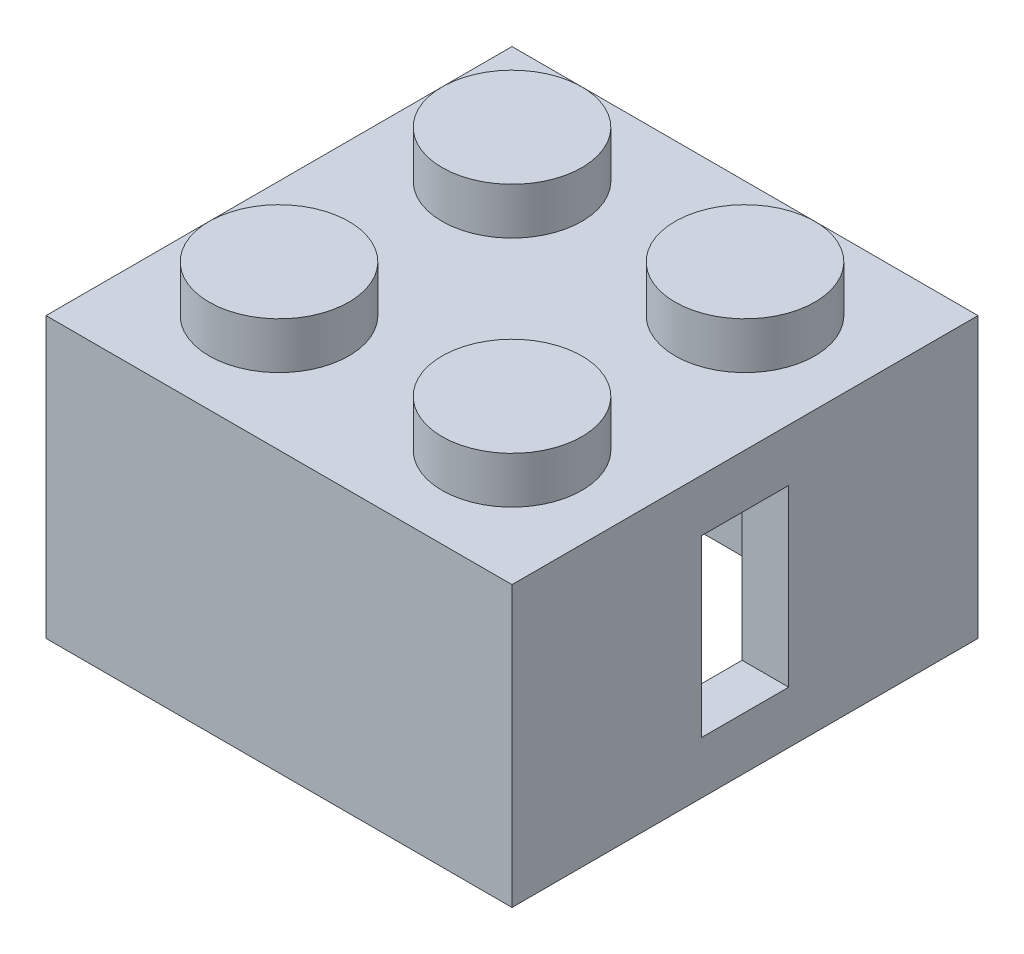
ISO-10303-21;
HEADER;
FILE_DESCRIPTION(('STEP AP214'),'2;1');
FILE_NAME('part.step','',(''),(''),'','','');
FILE_SCHEMA(('AUTOMOTIVE_DESIGN { 1 0 10303 214 1 1 1 1 }'));
ENDSEC;
DATA;
#1=APPLICATION_CONTEXT('core data for automotive mechanical design processes');
#2=APPLICATION_PROTOCOL_DEFINITION('international standard','automotive_design',2000,#1);
#3=PRODUCT_CONTEXT('',#1,'mechanical');
#4=PRODUCT('Part','Part','',(#3));
#5=PRODUCT_RELATED_PRODUCT_CATEGORY('part','',(#4));
#6=PRODUCT_DEFINITION_FORMATION('','',#4);
#7=PRODUCT_DEFINITION_CONTEXT('part definition',#1,'design');
#8=PRODUCT_DEFINITION('design','',#6,#7);
#9=PRODUCT_DEFINITION_SHAPE('','',#8);
#10=(LENGTH_UNIT() NAMED_UNIT(*) SI_UNIT(.MILLI.,.METRE.));
#11=(NAMED_UNIT(*) PLANE_ANGLE_UNIT() SI_UNIT($,.RADIAN.));
#12=(NAMED_UNIT(*) SI_UNIT($,.STERADIAN.) SOLID_ANGLE_UNIT());
#13=UNCERTAINTY_MEASURE_WITH_UNIT(LENGTH_MEASURE(1.E-05),#10,'distance_accuracy_value','');
#14=(GEOMETRIC_REPRESENTATION_CONTEXT(3) GLOBAL_UNCERTAINTY_ASSIGNED_CONTEXT((#13)) GLOBAL_UNIT_ASSIGNED_CONTEXT((#10,
#11,#12)) REPRESENTATION_CONTEXT('',''));
#15=CARTESIAN_POINT('',(0.,0.,0.));
#16=DIRECTION('',(0.,0.,1.));
#17=DIRECTION('',(1.,0.,0.));
#18=AXIS2_PLACEMENT_3D('',#15,#16,#17);
#19=CARTESIAN_POINT('',(0.,0.,0.));
#20=DIRECTION('',(0.,-1.,0.));
#21=DIRECTION('',(0.,0.,-1.));
#22=AXIS2_PLACEMENT_3D('',#19,#20,#21);
#23=PLANE('',#22);
#24=DIRECTION('',(0.,0.,1.));
#25=VECTOR('',#24,1.);
#26=CARTESIAN_POINT('',(0.,0.,0.));
#27=LINE('',#26,#25);
#28=CARTESIAN_POINT('',(0.,0.,-16.));
#29=VERTEX_POINT('',#28);
#30=CARTESIAN_POINT('',(0.,0.,0.));
#31=VERTEX_POINT('',#30);
#32=EDGE_CURVE('E242',#29,#31,#27,.T.);
#33=ORIENTED_EDGE('',*,*,#32,.F.);
#34=DIRECTION('',(-1.,0.,0.));
#35=VECTOR('',#34,1.);
#36=CARTESIAN_POINT('',(0.,0.,-16.));
#37=LINE('',#36,#35);
#38=CARTESIAN_POINT('',(16.,0.,-16.));
#39=VERTEX_POINT('',#38);
#40=EDGE_CURVE('E249',#39,#29,#37,.T.);
#41=ORIENTED_EDGE('',*,*,#40,.F.);
#42=DIRECTION('',(0.,0.,-1.));
#43=VECTOR('',#42,1.);
#44=CARTESIAN_POINT('',(16.,0.,0.));
#45=LINE('',#44,#43);
#46=CARTESIAN_POINT('',(16.,0.,0.));
#47=VERTEX_POINT('',#46);
#48=EDGE_CURVE('E247',#47,#39,#45,.T.);
#49=ORIENTED_EDGE('',*,*,#48,.F.);
#50=DIRECTION('',(1.,0.,0.));
#51=VECTOR('',#50,1.);
#52=CARTESIAN_POINT('',(0.,0.,0.));
#53=LINE('',#52,#51);
#54=EDGE_CURVE('E245',#31,#47,#53,.T.);
#55=ORIENTED_EDGE('',*,*,#54,.F.);
#56=EDGE_LOOP('',(#33,#41,#49,#55));
#57=FACE_BOUND('',#56,.T.);
#58=DIRECTION('',(0.,0.,1.));
#59=VECTOR('',#58,1.);
#60=CARTESIAN_POINT('',(1.6,0.,-1.6));
#61=LINE('',#60,#59);
#62=CARTESIAN_POINT('',(1.6,0.,-14.4));
#63=VERTEX_POINT('',#62);
#64=CARTESIAN_POINT('',(1.6,0.,-1.6));
#65=VERTEX_POINT('',#64);
#66=EDGE_CURVE('E211',#63,#65,#61,.T.);
#67=ORIENTED_EDGE('',*,*,#66,.T.);
#68=DIRECTION('',(1.,0.,0.));
#69=VECTOR('',#68,1.);
#70=CARTESIAN_POINT('',(1.6,0.,-1.6));
#71=LINE('',#70,#69);
#72=CARTESIAN_POINT('',(14.4,0.,-1.6));
#73=VERTEX_POINT('',#72);
#74=EDGE_CURVE('E206',#65,#73,#71,.T.);
#75=ORIENTED_EDGE('',*,*,#74,.T.);
#76=DIRECTION('',(0.,0.,-1.));
#77=VECTOR('',#76,1.);
#78=CARTESIAN_POINT('',(14.4,0.,-1.6));
#79=LINE('',#78,#77);
#80=CARTESIAN_POINT('',(14.4,0.,-14.4));
#81=VERTEX_POINT('',#80);
#82=EDGE_CURVE('E225',#73,#81,#79,.T.);
#83=ORIENTED_EDGE('',*,*,#82,.T.);
#84=DIRECTION('',(-1.,0.,0.));
#85=VECTOR('',#84,1.);
#86=CARTESIAN_POINT('',(1.6,0.,-14.4));
#87=LINE('',#86,#85);
#88=EDGE_CURVE('E228',#81,#63,#87,.T.);
#89=ORIENTED_EDGE('',*,*,#88,.T.);
#90=EDGE_LOOP('',(#67,#75,#83,#89));
#91=FACE_BOUND('',#90,.T.);
#92=ADVANCED_FACE('F33',(#57,#91),#23,.T.);
#93=CARTESIAN_POINT('',(0.,8.,0.));
#94=DIRECTION('',(1.,0.,0.));
#95=DIRECTION('',(0.,0.,-1.));
#96=AXIS2_PLACEMENT_3D('',#93,#94,#95);
#97=PLANE('',#96);
#98=CARTESIAN_POINT('',(0.,4.8,-8.00000000000001));
#99=DIRECTION('',(-1.,0.,0.));
#100=DIRECTION('',(0.,0.,1.));
#101=AXIS2_PLACEMENT_3D('',#98,#99,#100);
#102=CIRCLE('',#101,3.25);
#103=CARTESIAN_POINT('',(0.,4.8,-4.75000000000001));
#104=VERTEX_POINT('',#103);
#105=EDGE_CURVE('E161',#104,#104,#102,.T.);
#106=ORIENTED_EDGE('',*,*,#105,.F.);
#107=EDGE_LOOP('',(#106));
#108=FACE_BOUND('',#107,.T.);
#109=ORIENTED_EDGE('',*,*,#32,.T.);
#110=DIRECTION('',(0.,-1.,0.));
#111=VECTOR('',#110,1.);
#112=CARTESIAN_POINT('',(0.,8.,0.));
#113=LINE('',#112,#111);
#114=CARTESIAN_POINT('',(0.,9.6,0.));
#115=VERTEX_POINT('',#114);
#116=EDGE_CURVE('E11',#115,#31,#113,.T.);
#117=ORIENTED_EDGE('',*,*,#116,.F.);
#118=DIRECTION('',(0.,0.,1.));
#119=VECTOR('',#118,1.);
#120=CARTESIAN_POINT('',(0.,9.6,-16.));
#121=LINE('',#120,#119);
#122=CARTESIAN_POINT('',(0.,9.6,-16.));
#123=VERTEX_POINT('',#122);
#124=EDGE_CURVE('E192',#123,#115,#121,.T.);
#125=ORIENTED_EDGE('',*,*,#124,.F.);
#126=DIRECTION('',(0.,-1.,0.));
#127=VECTOR('',#126,1.);
#128=CARTESIAN_POINT('',(0.,8.,-16.));
#129=LINE('',#128,#127);
#130=EDGE_CURVE('E251',#123,#29,#129,.T.);
#131=ORIENTED_EDGE('',*,*,#130,.T.);
#132=EDGE_LOOP('',(#109,#117,#125,#131));
#133=FACE_BOUND('',#132,.T.);
#134=ADVANCED_FACE('F35',(#108,#133),#97,.F.);
#135=CARTESIAN_POINT('',(0.,8.,0.));
#136=DIRECTION('',(0.,0.,-1.));
#137=DIRECTION('',(-1.,0.,0.));
#138=AXIS2_PLACEMENT_3D('',#135,#136,#137);
#139=PLANE('',#138);
#140=ORIENTED_EDGE('',*,*,#54,.T.);
#141=DIRECTION('',(0.,-1.,0.));
#142=VECTOR('',#141,1.);
#143=CARTESIAN_POINT('',(16.,8.,0.));
#144=LINE('',#143,#142);
#145=CARTESIAN_POINT('',(16.,9.6,0.));
#146=VERTEX_POINT('',#145);
#147=EDGE_CURVE('E41',#146,#47,#144,.T.);
#148=ORIENTED_EDGE('',*,*,#147,.F.);
#149=DIRECTION('',(1.,0.,0.));
#150=VECTOR('',#149,1.);
#151=CARTESIAN_POINT('',(0.,9.6,0.));
#152=LINE('',#151,#150);
#153=EDGE_CURVE('E197',#115,#146,#152,.T.);
#154=ORIENTED_EDGE('',*,*,#153,.F.);
#155=ORIENTED_EDGE('',*,*,#116,.T.);
#156=EDGE_LOOP('',(#140,#148,#154,#155));
#157=FACE_BOUND('',#156,.T.);
#158=ADVANCED_FACE('F274',(#157),#139,.F.);
#159=CARTESIAN_POINT('',(16.,8.,0.));
#160=DIRECTION('',(-1.,0.,0.));
#161=DIRECTION('',(0.,0.,1.));
#162=AXIS2_PLACEMENT_3D('',#159,#160,#161);
#163=PLANE('',#162);
#164=DIRECTION('',(0.,0.,-1.));
#165=VECTOR('',#164,1.);
#166=CARTESIAN_POINT('',(16.,1.8,-6.49999999999995));
#167=LINE('',#166,#165);
#168=CARTESIAN_POINT('',(16.,1.8,-6.49999999999995));
#169=VERTEX_POINT('',#168);
#170=CARTESIAN_POINT('',(16.,1.8,-9.49999999999995));
#171=VERTEX_POINT('',#170);
#172=EDGE_CURVE('E155',#169,#171,#167,.T.);
#173=ORIENTED_EDGE('',*,*,#172,.F.);
#174=DIRECTION('',(0.,-1.,0.));
#175=VECTOR('',#174,1.);
#176=CARTESIAN_POINT('',(16.,1.8,-6.49999999999995));
#177=LINE('',#176,#175);
#178=CARTESIAN_POINT('',(16.,7.8,-6.49999999999995));
#179=VERTEX_POINT('',#178);
#180=EDGE_CURVE('E48',#179,#169,#177,.T.);
#181=ORIENTED_EDGE('',*,*,#180,.F.);
#182=DIRECTION('',(0.,0.,1.));
#183=VECTOR('',#182,1.);
#184=CARTESIAN_POINT('',(16.,7.8,-6.49999999999995));
#185=LINE('',#184,#183);
#186=CARTESIAN_POINT('',(16.,7.8,-9.49999999999995));
#187=VERTEX_POINT('',#186);
#188=EDGE_CURVE('E146',#187,#179,#185,.T.);
#189=ORIENTED_EDGE('',*,*,#188,.F.);
#190=DIRECTION('',(0.,1.,0.));
#191=VECTOR('',#190,1.);
#192=CARTESIAN_POINT('',(16.,1.8,-9.49999999999995));
#193=LINE('',#192,#191);
#194=EDGE_CURVE('E149',#171,#187,#193,.T.);
#195=ORIENTED_EDGE('',*,*,#194,.F.);
#196=EDGE_LOOP('',(#173,#181,#189,#195));
#197=FACE_BOUND('',#196,.T.);
#198=ORIENTED_EDGE('',*,*,#48,.T.);
#199=DIRECTION('',(0.,-1.,0.));
#200=VECTOR('',#199,1.);
#201=CARTESIAN_POINT('',(16.,8.,-16.));
#202=LINE('',#201,#200);
#203=CARTESIAN_POINT('',(16.,9.6,-16.));
#204=VERTEX_POINT('',#203);
#205=EDGE_CURVE('E254',#204,#39,#202,.T.);
#206=ORIENTED_EDGE('',*,*,#205,.F.);
#207=DIRECTION('',(0.,0.,-1.));
#208=VECTOR('',#207,1.);
#209=CARTESIAN_POINT('',(16.,9.6,0.));
#210=LINE('',#209,#208);
#211=EDGE_CURVE('E200',#146,#204,#210,.T.);
#212=ORIENTED_EDGE('',*,*,#211,.F.);
#213=ORIENTED_EDGE('',*,*,#147,.T.);
#214=EDGE_LOOP('',(#198,#206,#212,#213));
#215=FACE_BOUND('',#214,.T.);
#216=ADVANCED_FACE('F260',(#197,#215),#163,.F.);
#217=CARTESIAN_POINT('',(0.,8.,-16.));
#218=DIRECTION('',(0.,0.,1.));
#219=DIRECTION('',(1.,0.,0.));
#220=AXIS2_PLACEMENT_3D('',#217,#218,#219);
#221=PLANE('',#220);
#222=ORIENTED_EDGE('',*,*,#40,.T.);
#223=ORIENTED_EDGE('',*,*,#130,.F.);
#224=DIRECTION('',(-1.,0.,0.));
#225=VECTOR('',#224,1.);
#226=CARTESIAN_POINT('',(16.,9.6,-16.));
#227=LINE('',#226,#225);
#228=EDGE_CURVE('E203',#204,#123,#227,.T.);
#229=ORIENTED_EDGE('',*,*,#228,.F.);
#230=ORIENTED_EDGE('',*,*,#205,.T.);
#231=EDGE_LOOP('',(#222,#223,#229,#230));
#232=FACE_BOUND('',#231,.T.);
#233=ADVANCED_FACE('F268',(#232),#221,.F.);
#234=CARTESIAN_POINT('',(1.6,8.,-1.6));
#235=DIRECTION('',(0.,0.,-1.));
#236=DIRECTION('',(-1.,0.,0.));
#237=AXIS2_PLACEMENT_3D('',#234,#235,#236);
#238=PLANE('',#237);
#239=ORIENTED_EDGE('',*,*,#74,.F.);
#240=DIRECTION('',(0.,-1.,0.));
#241=VECTOR('',#240,1.);
#242=CARTESIAN_POINT('',(1.6,8.,-1.6));
#243=LINE('',#242,#241);
#244=CARTESIAN_POINT('',(1.6,8.,-1.6));
#245=VERTEX_POINT('',#244);
#246=EDGE_CURVE('E221',#245,#65,#243,.T.);
#247=ORIENTED_EDGE('',*,*,#246,.F.);
#248=DIRECTION('',(1.,0.,0.));
#249=VECTOR('',#248,1.);
#250=CARTESIAN_POINT('',(1.6,8.,-1.6));
#251=LINE('',#250,#249);
#252=CARTESIAN_POINT('',(14.4,8.,-1.6));
#253=VERTEX_POINT('',#252);
#254=EDGE_CURVE('E207',#245,#253,#251,.T.);
#255=ORIENTED_EDGE('',*,*,#254,.T.);
#256=DIRECTION('',(0.,-1.,0.));
#257=VECTOR('',#256,1.);
#258=CARTESIAN_POINT('',(14.4,8.,-1.6));
#259=LINE('',#258,#257);
#260=EDGE_CURVE('E239',#253,#73,#259,.T.);
#261=ORIENTED_EDGE('',*,*,#260,.T.);
#262=EDGE_LOOP('',(#239,#247,#255,#261));
#263=FACE_BOUND('',#262,.T.);
#264=ADVANCED_FACE('F289',(#263),#238,.T.);
#265=CARTESIAN_POINT('',(14.4,8.,-1.6));
#266=DIRECTION('',(-1.,0.,0.));
#267=DIRECTION('',(0.,0.,1.));
#268=AXIS2_PLACEMENT_3D('',#265,#266,#267);
#269=PLANE('',#268);
#270=DIRECTION('',(0.,-1.,0.));
#271=VECTOR('',#270,1.);
#272=CARTESIAN_POINT('',(14.4,1.8,-6.49999999999996));
#273=LINE('',#272,#271);
#274=CARTESIAN_POINT('',(14.4,7.8,-6.49999999999996));
#275=VERTEX_POINT('',#274);
#276=CARTESIAN_POINT('',(14.4,1.8,-6.49999999999996));
#277=VERTEX_POINT('',#276);
#278=EDGE_CURVE('E130',#275,#277,#273,.T.);
#279=ORIENTED_EDGE('',*,*,#278,.T.);
#280=DIRECTION('',(0.,0.,-1.));
#281=VECTOR('',#280,1.);
#282=CARTESIAN_POINT('',(14.4,1.8,-6.49999999999996));
#283=LINE('',#282,#281);
#284=CARTESIAN_POINT('',(14.4,1.8,-9.49999999999996));
#285=VERTEX_POINT('',#284);
#286=EDGE_CURVE('E139',#277,#285,#283,.T.);
#287=ORIENTED_EDGE('',*,*,#286,.T.);
#288=DIRECTION('',(0.,1.,0.));
#289=VECTOR('',#288,1.);
#290=CARTESIAN_POINT('',(14.4,1.8,-9.49999999999996));
#291=LINE('',#290,#289);
#292=CARTESIAN_POINT('',(14.4,7.8,-9.49999999999996));
#293=VERTEX_POINT('',#292);
#294=EDGE_CURVE('E56',#285,#293,#291,.T.);
#295=ORIENTED_EDGE('',*,*,#294,.T.);
#296=DIRECTION('',(0.,0.,1.));
#297=VECTOR('',#296,1.);
#298=CARTESIAN_POINT('',(14.4,7.8,-6.49999999999996));
#299=LINE('',#298,#297);
#300=EDGE_CURVE('E136',#293,#275,#299,.T.);
#301=ORIENTED_EDGE('',*,*,#300,.T.);
#302=EDGE_LOOP('',(#279,#287,#295,#301));
#303=FACE_BOUND('',#302,.T.);
#304=ORIENTED_EDGE('',*,*,#82,.F.);
#305=ORIENTED_EDGE('',*,*,#260,.F.);
#306=DIRECTION('',(0.,0.,-1.));
#307=VECTOR('',#306,1.);
#308=CARTESIAN_POINT('',(14.4,8.,-1.6));
#309=LINE('',#308,#307);
#310=CARTESIAN_POINT('',(14.4,8.,-14.4));
#311=VERTEX_POINT('',#310);
#312=EDGE_CURVE('E210',#253,#311,#309,.T.);
#313=ORIENTED_EDGE('',*,*,#312,.T.);
#314=DIRECTION('',(0.,-1.,0.));
#315=VECTOR('',#314,1.);
#316=CARTESIAN_POINT('',(14.4,8.,-14.4));
#317=LINE('',#316,#315);
#318=EDGE_CURVE('E237',#311,#81,#317,.T.);
#319=ORIENTED_EDGE('',*,*,#318,.T.);
#320=EDGE_LOOP('',(#304,#305,#313,#319));
#321=FACE_BOUND('',#320,.T.);
#322=ADVANCED_FACE('F143',(#303,#321),#269,.T.);
#323=CARTESIAN_POINT('',(1.6,8.,-14.4));
#324=DIRECTION('',(0.,0.,1.));
#325=DIRECTION('',(1.,0.,0.));
#326=AXIS2_PLACEMENT_3D('',#323,#324,#325);
#327=PLANE('',#326);
#328=ORIENTED_EDGE('',*,*,#88,.F.);
#329=ORIENTED_EDGE('',*,*,#318,.F.);
#330=DIRECTION('',(-1.,0.,0.));
#331=VECTOR('',#330,1.);
#332=CARTESIAN_POINT('',(1.6,8.,-14.4));
#333=LINE('',#332,#331);
#334=CARTESIAN_POINT('',(1.6,8.,-14.4));
#335=VERTEX_POINT('',#334);
#336=EDGE_CURVE('E214',#311,#335,#333,.T.);
#337=ORIENTED_EDGE('',*,*,#336,.T.);
#338=DIRECTION('',(0.,-1.,0.));
#339=VECTOR('',#338,1.);
#340=CARTESIAN_POINT('',(1.6,8.,-14.4));
#341=LINE('',#340,#339);
#342=EDGE_CURVE('E235',#335,#63,#341,.T.);
#343=ORIENTED_EDGE('',*,*,#342,.T.);
#344=EDGE_LOOP('',(#328,#329,#337,#343));
#345=FACE_BOUND('',#344,.T.);
#346=ADVANCED_FACE('F299',(#345),#327,.T.);
#347=CARTESIAN_POINT('',(1.6,8.,-1.6));
#348=DIRECTION('',(1.,0.,0.));
#349=DIRECTION('',(0.,0.,-1.));
#350=AXIS2_PLACEMENT_3D('',#347,#348,#349);
#351=PLANE('',#350);
#352=CARTESIAN_POINT('',(1.6,4.8,-8.00000000000001));
#353=DIRECTION('',(1.,0.,0.));
#354=DIRECTION('',(0.,0.,-1.));
#355=AXIS2_PLACEMENT_3D('',#352,#353,#354);
#356=CIRCLE('',#355,3.25);
#357=CARTESIAN_POINT('',(1.6,8.,-8.56789083458003));
#358=VERTEX_POINT('',#357);
#359=CARTESIAN_POINT('',(1.6,8.,-7.43210916541998));
#360=VERTEX_POINT('',#359);
#361=EDGE_CURVE('E167',#358,#360,#356,.F.);
#362=ORIENTED_EDGE('',*,*,#361,.T.);
#363=DIRECTION('',(0.,0.,1.));
#364=VECTOR('',#363,1.);
#365=CARTESIAN_POINT('',(1.6,8.,-1.6));
#366=LINE('',#365,#364);
#367=EDGE_CURVE('E217',#360,#245,#366,.T.);
#368=ORIENTED_EDGE('',*,*,#367,.T.);
#369=ORIENTED_EDGE('',*,*,#246,.T.);
#370=ORIENTED_EDGE('',*,*,#66,.F.);
#371=ORIENTED_EDGE('',*,*,#342,.F.);
#372=EDGE_CURVE('E218',#335,#358,#366,.T.);
#373=ORIENTED_EDGE('',*,*,#372,.T.);
#374=EDGE_LOOP('',(#362,#368,#369,#370,#371,#373));
#375=FACE_BOUND('',#374,.T.);
#376=ADVANCED_FACE('F305',(#375),#351,.T.);
#377=CARTESIAN_POINT('',(0.,8.,0.));
#378=DIRECTION('',(0.,1.,0.));
#379=DIRECTION('',(0.,0.,1.));
#380=AXIS2_PLACEMENT_3D('',#377,#378,#379);
#381=PLANE('',#380);
#382=ORIENTED_EDGE('',*,*,#254,.F.);
#383=ORIENTED_EDGE('',*,*,#367,.F.);
#384=EDGE_CURVE('E222',#358,#360,#366,.T.);
#385=ORIENTED_EDGE('',*,*,#384,.F.);
#386=ORIENTED_EDGE('',*,*,#372,.F.);
#387=ORIENTED_EDGE('',*,*,#336,.F.);
#388=ORIENTED_EDGE('',*,*,#312,.F.);
#389=EDGE_LOOP('',(#382,#383,#385,#386,#387,#388));
#390=FACE_BOUND('',#389,.T.);
#391=ADVANCED_FACE('F315',(#390),#381,.F.);
#392=CARTESIAN_POINT('',(0.,9.6,0.));
#393=DIRECTION('',(0.,1.,0.));
#394=DIRECTION('',(0.,0.,1.));
#395=AXIS2_PLACEMENT_3D('',#392,#393,#394);
#396=PLANE('',#395);
#397=CARTESIAN_POINT('',(12.,9.6,-12.));
#398=DIRECTION('',(0.,1.,0.));
#399=DIRECTION('',(0.,0.,1.));
#400=AXIS2_PLACEMENT_3D('',#397,#398,#399);
#401=CIRCLE('',#400,2.4);
#402=CARTESIAN_POINT('',(12.,9.6,-9.60000000000001));
#403=VERTEX_POINT('',#402);
#404=EDGE_CURVE('E170',#403,#403,#401,.T.);
#405=ORIENTED_EDGE('',*,*,#404,.F.);
#406=EDGE_LOOP('',(#405));
#407=FACE_BOUND('',#406,.T.);
#408=CARTESIAN_POINT('',(3.99999999999998,9.6,-12.));
#409=DIRECTION('',(0.,1.,0.));
#410=DIRECTION('',(0.,0.,1.));
#411=AXIS2_PLACEMENT_3D('',#408,#409,#410);
#412=CIRCLE('',#411,2.4);
#413=CARTESIAN_POINT('',(3.99999999999998,9.6,-9.60000000000001));
#414=VERTEX_POINT('',#413);
#415=EDGE_CURVE('E174',#414,#414,#412,.T.);
#416=ORIENTED_EDGE('',*,*,#415,.F.);
#417=EDGE_LOOP('',(#416));
#418=FACE_BOUND('',#417,.T.);
#419=CARTESIAN_POINT('',(3.99999999999998,9.6,-4.00000000000001));
#420=DIRECTION('',(0.,1.,0.));
#421=DIRECTION('',(0.,0.,1.));
#422=AXIS2_PLACEMENT_3D('',#419,#420,#421);
#423=CIRCLE('',#422,2.4);
#424=CARTESIAN_POINT('',(3.99999999999998,9.6,-1.60000000000001));
#425=VERTEX_POINT('',#424);
#426=EDGE_CURVE('E180',#425,#425,#423,.T.);
#427=ORIENTED_EDGE('',*,*,#426,.F.);
#428=EDGE_LOOP('',(#427));
#429=FACE_BOUND('',#428,.T.);
#430=CARTESIAN_POINT('',(12.,9.6,-4.00000000000001));
#431=DIRECTION('',(0.,1.,0.));
#432=DIRECTION('',(0.,0.,1.));
#433=AXIS2_PLACEMENT_3D('',#430,#431,#432);
#434=CIRCLE('',#433,2.4);
#435=CARTESIAN_POINT('',(12.,9.6,-1.60000000000001));
#436=VERTEX_POINT('',#435);
#437=EDGE_CURVE('E186',#436,#436,#434,.T.);
#438=ORIENTED_EDGE('',*,*,#437,.F.);
#439=EDGE_LOOP('',(#438));
#440=FACE_BOUND('',#439,.T.);
#441=ORIENTED_EDGE('',*,*,#124,.T.);
#442=ORIENTED_EDGE('',*,*,#153,.T.);
#443=ORIENTED_EDGE('',*,*,#211,.T.);
#444=ORIENTED_EDGE('',*,*,#228,.T.);
#445=EDGE_LOOP('',(#441,#442,#443,#444));
#446=FACE_BOUND('',#445,.T.);
#447=ADVANCED_FACE('F273',(#407,#418,#429,#440,#446),#396,.T.);
#448=CARTESIAN_POINT('',(12.,11.2,-4.00000000000001));
#449=DIRECTION('',(0.,-1.,0.));
#450=DIRECTION('',(0.,0.,-1.));
#451=AXIS2_PLACEMENT_3D('',#448,#449,#450);
#452=CYLINDRICAL_SURFACE('',#451,2.4);
#453=CARTESIAN_POINT('',(12.,11.2,-4.00000000000001));
#454=DIRECTION('',(0.,1.,0.));
#455=DIRECTION('',(0.,0.,1.));
#456=AXIS2_PLACEMENT_3D('',#453,#454,#455);
#457=CIRCLE('',#456,2.4);
#458=CARTESIAN_POINT('',(12.,11.2,-1.60000000000001));
#459=VERTEX_POINT('',#458);
#460=EDGE_CURVE('E189',#459,#459,#457,.T.);
#461=ORIENTED_EDGE('',*,*,#460,.F.);
#462=EDGE_LOOP('',(#461));
#463=FACE_BOUND('',#462,.T.);
#464=ORIENTED_EDGE('',*,*,#437,.T.);
#465=EDGE_LOOP('',(#464));
#466=FACE_BOUND('',#465,.T.);
#467=ADVANCED_FACE('F360',(#463,#466),#452,.T.);
#468=CARTESIAN_POINT('',(0.,11.2,0.));
#469=DIRECTION('',(0.,1.,0.));
#470=DIRECTION('',(0.,0.,1.));
#471=AXIS2_PLACEMENT_3D('',#468,#469,#470);
#472=PLANE('',#471);
#473=ORIENTED_EDGE('',*,*,#460,.T.);
#474=EDGE_LOOP('',(#473));
#475=FACE_BOUND('',#474,.T.);
#476=ADVANCED_FACE('F356',(#475),#472,.T.);
#477=CARTESIAN_POINT('',(3.99999999999998,11.2,-4.00000000000001));
#478=DIRECTION('',(0.,-1.,0.));
#479=DIRECTION('',(0.,0.,-1.));
#480=AXIS2_PLACEMENT_3D('',#477,#478,#479);
#481=CYLINDRICAL_SURFACE('',#480,2.4);
#482=CARTESIAN_POINT('',(3.99999999999998,11.2,-4.00000000000001));
#483=DIRECTION('',(0.,1.,0.));
#484=DIRECTION('',(0.,0.,1.));
#485=AXIS2_PLACEMENT_3D('',#482,#483,#484);
#486=CIRCLE('',#485,2.4);
#487=CARTESIAN_POINT('',(3.99999999999998,11.2,-1.60000000000001));
#488=VERTEX_POINT('',#487);
#489=EDGE_CURVE('E183',#488,#488,#486,.T.);
#490=ORIENTED_EDGE('',*,*,#489,.F.);
#491=EDGE_LOOP('',(#490));
#492=FACE_BOUND('',#491,.T.);
#493=ORIENTED_EDGE('',*,*,#426,.T.);
#494=EDGE_LOOP('',(#493));
#495=FACE_BOUND('',#494,.T.);
#496=ADVANCED_FACE('F352',(#492,#495),#481,.T.);
#497=CARTESIAN_POINT('',(0.,11.2,0.));
#498=DIRECTION('',(0.,1.,0.));
#499=DIRECTION('',(0.,0.,1.));
#500=AXIS2_PLACEMENT_3D('',#497,#498,#499);
#501=PLANE('',#500);
#502=ORIENTED_EDGE('',*,*,#489,.T.);
#503=EDGE_LOOP('',(#502));
#504=FACE_BOUND('',#503,.T.);
#505=ADVANCED_FACE('F348',(#504),#501,.T.);
#506=CARTESIAN_POINT('',(3.99999999999998,11.2,-12.));
#507=DIRECTION('',(0.,-1.,0.));
#508=DIRECTION('',(0.,0.,-1.));
#509=AXIS2_PLACEMENT_3D('',#506,#507,#508);
#510=CYLINDRICAL_SURFACE('',#509,2.4);
#511=CARTESIAN_POINT('',(3.99999999999998,11.2,-12.));
#512=DIRECTION('',(0.,1.,0.));
#513=DIRECTION('',(0.,0.,1.));
#514=AXIS2_PLACEMENT_3D('',#511,#512,#513);
#515=CIRCLE('',#514,2.4);
#516=CARTESIAN_POINT('',(3.99999999999998,11.2,-9.60000000000001));
#517=VERTEX_POINT('',#516);
#518=EDGE_CURVE('E177',#517,#517,#515,.T.);
#519=ORIENTED_EDGE('',*,*,#518,.F.);
#520=EDGE_LOOP('',(#519));
#521=FACE_BOUND('',#520,.T.);
#522=ORIENTED_EDGE('',*,*,#415,.T.);
#523=EDGE_LOOP('',(#522));
#524=FACE_BOUND('',#523,.T.);
#525=ADVANCED_FACE('F344',(#521,#524),#510,.T.);
#526=CARTESIAN_POINT('',(0.,11.2,0.));
#527=DIRECTION('',(0.,1.,0.));
#528=DIRECTION('',(0.,0.,1.));
#529=AXIS2_PLACEMENT_3D('',#526,#527,#528);
#530=PLANE('',#529);
#531=ORIENTED_EDGE('',*,*,#518,.T.);
#532=EDGE_LOOP('',(#531));
#533=FACE_BOUND('',#532,.T.);
#534=ADVANCED_FACE('F340',(#533),#530,.T.);
#535=CARTESIAN_POINT('',(12.,11.2,-12.));
#536=DIRECTION('',(0.,-1.,0.));
#537=DIRECTION('',(0.,0.,-1.));
#538=AXIS2_PLACEMENT_3D('',#535,#536,#537);
#539=CYLINDRICAL_SURFACE('',#538,2.4);
#540=CARTESIAN_POINT('',(12.,11.2,-12.));
#541=DIRECTION('',(0.,1.,0.));
#542=DIRECTION('',(0.,0.,1.));
#543=AXIS2_PLACEMENT_3D('',#540,#541,#542);
#544=CIRCLE('',#543,2.4);
#545=CARTESIAN_POINT('',(12.,11.2,-9.60000000000001));
#546=VERTEX_POINT('',#545);
#547=EDGE_CURVE('E171',#546,#546,#544,.T.);
#548=ORIENTED_EDGE('',*,*,#547,.F.);
#549=EDGE_LOOP('',(#548));
#550=FACE_BOUND('',#549,.T.);
#551=ORIENTED_EDGE('',*,*,#404,.T.);
#552=EDGE_LOOP('',(#551));
#553=FACE_BOUND('',#552,.T.);
#554=ADVANCED_FACE('F336',(#550,#553),#539,.T.);
#555=CARTESIAN_POINT('',(0.,11.2,0.));
#556=DIRECTION('',(0.,1.,0.));
#557=DIRECTION('',(0.,0.,1.));
#558=AXIS2_PLACEMENT_3D('',#555,#556,#557);
#559=PLANE('',#558);
#560=ORIENTED_EDGE('',*,*,#547,.T.);
#561=EDGE_LOOP('',(#560));
#562=FACE_BOUND('',#561,.T.);
#563=ADVANCED_FACE('F330',(#562),#559,.T.);
#564=CARTESIAN_POINT('',(1.6,8.,-1.6));
#565=DIRECTION('',(1.,0.,0.));
#566=DIRECTION('',(0.,0.,-1.));
#567=AXIS2_PLACEMENT_3D('',#564,#565,#566);
#568=PLANE('',#567);
#569=EDGE_CURVE('E168',#360,#358,#356,.F.);
#570=ORIENTED_EDGE('',*,*,#569,.T.);
#571=ORIENTED_EDGE('',*,*,#384,.T.);
#572=EDGE_LOOP('',(#570,#571));
#573=FACE_BOUND('',#572,.T.);
#574=ADVANCED_FACE('F318',(#573),#568,.F.);
#575=CARTESIAN_POINT('',(10.7923881554251,4.8,-8.00000000000001));
#576=DIRECTION('',(-1.,0.,0.));
#577=DIRECTION('',(0.,0.,1.));
#578=AXIS2_PLACEMENT_3D('',#575,#576,#577);
#579=CYLINDRICAL_SURFACE('',#578,3.25);
#580=ORIENTED_EDGE('',*,*,#105,.T.);
#581=EDGE_LOOP('',(#580));
#582=FACE_BOUND('',#581,.T.);
#583=ORIENTED_EDGE('',*,*,#569,.F.);
#584=ORIENTED_EDGE('',*,*,#361,.F.);
#585=EDGE_LOOP('',(#583,#584));
#586=FACE_BOUND('',#585,.T.);
#587=ADVANCED_FACE('F320',(#582,#586),#579,.F.);
#588=CARTESIAN_POINT('',(14.4,1.8,-6.49999999999996));
#589=DIRECTION('',(0.,0.,1.));
#590=DIRECTION('',(1.,0.,0.));
#591=AXIS2_PLACEMENT_3D('',#588,#589,#590);
#592=PLANE('',#591);
#593=ORIENTED_EDGE('',*,*,#180,.T.);
#594=DIRECTION('',(1.,0.,0.));
#595=VECTOR('',#594,1.);
#596=CARTESIAN_POINT('',(14.4,1.8,-6.49999999999996));
#597=LINE('',#596,#595);
#598=EDGE_CURVE('E126',#277,#169,#597,.T.);
#599=ORIENTED_EDGE('',*,*,#598,.F.);
#600=ORIENTED_EDGE('',*,*,#278,.F.);
#601=DIRECTION('',(1.,0.,0.));
#602=VECTOR('',#601,1.);
#603=CARTESIAN_POINT('',(14.4,7.8,-6.49999999999996));
#604=LINE('',#603,#602);
#605=EDGE_CURVE('E159',#275,#179,#604,.T.);
#606=ORIENTED_EDGE('',*,*,#605,.T.);
#607=EDGE_LOOP('',(#593,#599,#600,#606));
#608=FACE_BOUND('',#607,.T.);
#609=ADVANCED_FACE('F128',(#608),#592,.F.);
#610=CARTESIAN_POINT('',(14.4,7.8,-6.49999999999996));
#611=DIRECTION('',(0.,1.,0.));
#612=DIRECTION('',(0.,0.,1.));
#613=AXIS2_PLACEMENT_3D('',#610,#611,#612);
#614=PLANE('',#613);
#615=ORIENTED_EDGE('',*,*,#188,.T.);
#616=ORIENTED_EDGE('',*,*,#605,.F.);
#617=ORIENTED_EDGE('',*,*,#300,.F.);
#618=DIRECTION('',(1.,0.,0.));
#619=VECTOR('',#618,1.);
#620=CARTESIAN_POINT('',(14.4,7.8,-9.49999999999996));
#621=LINE('',#620,#619);
#622=EDGE_CURVE('E162',#293,#187,#621,.T.);
#623=ORIENTED_EDGE('',*,*,#622,.T.);
#624=EDGE_LOOP('',(#615,#616,#617,#623));
#625=FACE_BOUND('',#624,.T.);
#626=ADVANCED_FACE('F328',(#625),#614,.F.);
#627=CARTESIAN_POINT('',(14.4,1.8,-9.49999999999996));
#628=DIRECTION('',(0.,0.,-1.));
#629=DIRECTION('',(-1.,0.,0.));
#630=AXIS2_PLACEMENT_3D('',#627,#628,#629);
#631=PLANE('',#630);
#632=ORIENTED_EDGE('',*,*,#194,.T.);
#633=ORIENTED_EDGE('',*,*,#622,.F.);
#634=ORIENTED_EDGE('',*,*,#294,.F.);
#635=DIRECTION('',(1.,0.,0.));
#636=VECTOR('',#635,1.);
#637=CARTESIAN_POINT('',(14.4,1.8,-9.49999999999996));
#638=LINE('',#637,#636);
#639=EDGE_CURVE('E135',#285,#171,#638,.T.);
#640=ORIENTED_EDGE('',*,*,#639,.T.);
#641=EDGE_LOOP('',(#632,#633,#634,#640));
#642=FACE_BOUND('',#641,.T.);
#643=ADVANCED_FACE('F459',(#642),#631,.F.);
#644=CARTESIAN_POINT('',(14.4,1.8,-6.49999999999996));
#645=DIRECTION('',(0.,-1.,0.));
#646=DIRECTION('',(0.,0.,-1.));
#647=AXIS2_PLACEMENT_3D('',#644,#645,#646);
#648=PLANE('',#647);
#649=ORIENTED_EDGE('',*,*,#172,.T.);
#650=ORIENTED_EDGE('',*,*,#639,.F.);
#651=ORIENTED_EDGE('',*,*,#286,.F.);
#652=ORIENTED_EDGE('',*,*,#598,.T.);
#653=EDGE_LOOP('',(#649,#650,#651,#652));
#654=FACE_BOUND('',#653,.T.);
#655=ADVANCED_FACE('F140',(#654),#648,.F.);
#656=CLOSED_SHELL('',(#92,#134,#158,#216,#233,#264,#322,#346,#376,#391,#447,#467,#476,#496,#505,
#525,#534,#554,#563,#574,#587,#609,#626,#643,#655));
#657=MANIFOLD_SOLID_BREP('B2',#656);
#658=ADVANCED_BREP_SHAPE_REPRESENTATION('',(#18,#657),#14);
#659=SHAPE_DEFINITION_REPRESENTATION(#9,#658);
ENDSEC;
END-ISO-10303-21;
